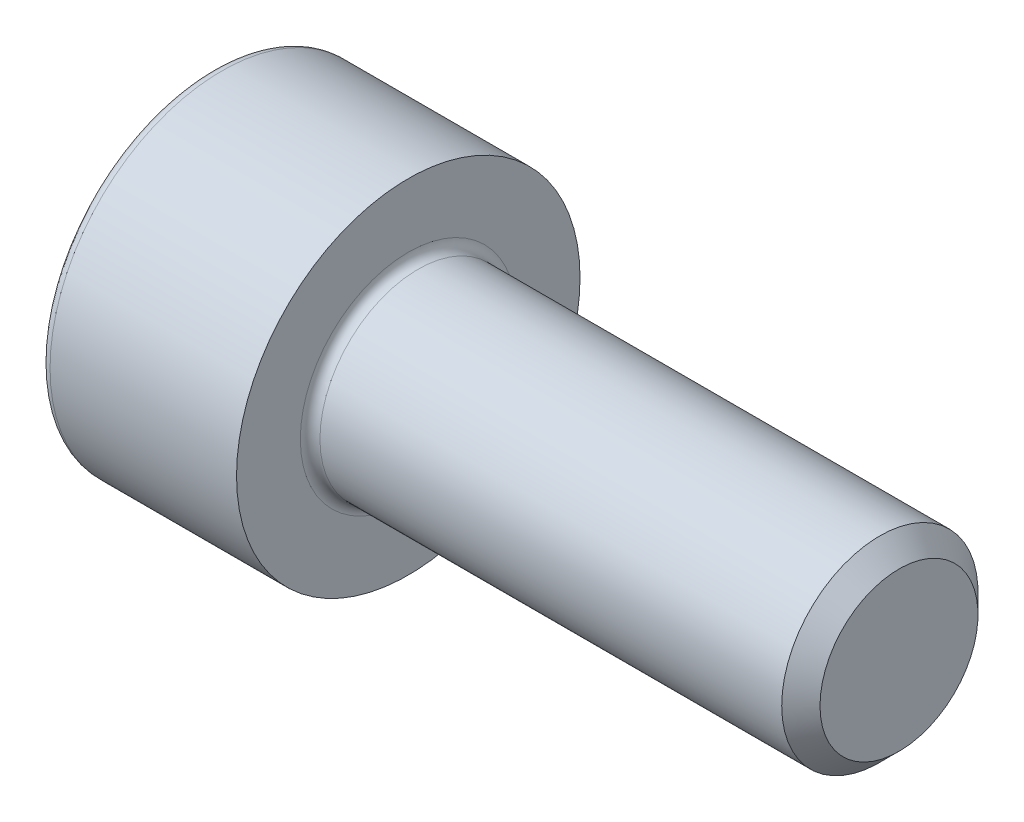
ISO-10303-21;
HEADER;
FILE_DESCRIPTION(('STEP AP214'),'2;1');
FILE_NAME('part.step','',(''),(''),'','','');
FILE_SCHEMA(('AUTOMOTIVE_DESIGN { 1 0 10303 214 1 1 1 1 }'));
ENDSEC;
DATA;
#1=APPLICATION_CONTEXT('core data for automotive mechanical design processes');
#2=APPLICATION_PROTOCOL_DEFINITION('international standard','automotive_design',2000,#1);
#3=PRODUCT_CONTEXT('',#1,'mechanical');
#4=PRODUCT('Part','Part','',(#3));
#5=PRODUCT_RELATED_PRODUCT_CATEGORY('part','',(#4));
#6=PRODUCT_DEFINITION_FORMATION('','',#4);
#7=PRODUCT_DEFINITION_CONTEXT('part definition',#1,'design');
#8=PRODUCT_DEFINITION('design','',#6,#7);
#9=PRODUCT_DEFINITION_SHAPE('','',#8);
#10=(LENGTH_UNIT() NAMED_UNIT(*) SI_UNIT(.MILLI.,.METRE.));
#11=(NAMED_UNIT(*) PLANE_ANGLE_UNIT() SI_UNIT($,.RADIAN.));
#12=(NAMED_UNIT(*) SI_UNIT($,.STERADIAN.) SOLID_ANGLE_UNIT());
#13=UNCERTAINTY_MEASURE_WITH_UNIT(LENGTH_MEASURE(1.E-05),#10,'distance_accuracy_value','');
#14=(GEOMETRIC_REPRESENTATION_CONTEXT(3) GLOBAL_UNCERTAINTY_ASSIGNED_CONTEXT((#13)) GLOBAL_UNIT_ASSIGNED_CONTEXT((#10,
#11,#12)) REPRESENTATION_CONTEXT('',''));
#15=CARTESIAN_POINT('',(0.,0.,0.));
#16=DIRECTION('',(0.,0.,1.));
#17=DIRECTION('',(1.,0.,0.));
#18=AXIS2_PLACEMENT_3D('',#15,#16,#17);
#19=CARTESIAN_POINT('',(2.,1.73205080756888,0.));
#20=DIRECTION('',(1.,0.,0.));
#21=DIRECTION('',(0.,0.,-1.));
#22=AXIS2_PLACEMENT_3D('',#19,#20,#21);
#23=PLANE('',#22);
#24=CARTESIAN_POINT('',(2.,0.,0.));
#25=DIRECTION('',(1.,0.,0.));
#26=DIRECTION('',(0.,0.,-1.));
#27=AXIS2_PLACEMENT_3D('',#24,#25,#26);
#28=CIRCLE('',#27,1.5);
#29=CARTESIAN_POINT('',(2.,0.,-1.5));
#30=VERTEX_POINT('',#29);
#31=CARTESIAN_POINT('',(2.,-1.29903810567666,-0.749999999999999));
#32=VERTEX_POINT('',#31);
#33=EDGE_CURVE('E11',#30,#32,#28,.F.);
#34=ORIENTED_EDGE('',*,*,#33,.F.);
#35=DIRECTION('',(0.,1.,0.));
#36=VECTOR('',#35,1.);
#37=CARTESIAN_POINT('',(2.,-0.866025403784439,-1.5));
#38=LINE('',#37,#36);
#39=CARTESIAN_POINT('',(2.,-0.866025403784439,-1.5));
#40=VERTEX_POINT('',#39);
#41=EDGE_CURVE('E177',#40,#30,#38,.T.);
#42=ORIENTED_EDGE('',*,*,#41,.F.);
#43=DIRECTION('',(0.,0.5,-0.866025403784439));
#44=VECTOR('',#43,1.);
#45=CARTESIAN_POINT('',(2.,-1.73205080756888,0.));
#46=LINE('',#45,#44);
#47=EDGE_CURVE('E173',#32,#40,#46,.T.);
#48=ORIENTED_EDGE('',*,*,#47,.F.);
#49=EDGE_LOOP('',(#34,#42,#48));
#50=FACE_BOUND('',#49,.T.);
#51=ADVANCED_FACE('F33',(#50),#23,.F.);
#52=CARTESIAN_POINT('',(2.,-1.29903810567666,0.75));
#53=VERTEX_POINT('',#52);
#54=EDGE_CURVE('E42',#32,#53,#28,.F.);
#55=ORIENTED_EDGE('',*,*,#54,.F.);
#56=CARTESIAN_POINT('',(2.,-1.73205080756888,0.));
#57=VERTEX_POINT('',#56);
#58=EDGE_CURVE('E174',#57,#32,#46,.T.);
#59=ORIENTED_EDGE('',*,*,#58,.F.);
#60=DIRECTION('',(0.,-0.5,-0.866025403784439));
#61=VECTOR('',#60,1.);
#62=CARTESIAN_POINT('',(2.,-0.866025403784439,1.5));
#63=LINE('',#62,#61);
#64=EDGE_CURVE('E169',#53,#57,#63,.T.);
#65=ORIENTED_EDGE('',*,*,#64,.F.);
#66=EDGE_LOOP('',(#55,#59,#65));
#67=FACE_BOUND('',#66,.T.);
#68=ADVANCED_FACE('F117',(#67),#23,.F.);
#69=CARTESIAN_POINT('',(2.,0.,1.5));
#70=VERTEX_POINT('',#69);
#71=EDGE_CURVE('E253',#53,#70,#28,.F.);
#72=ORIENTED_EDGE('',*,*,#71,.F.);
#73=CARTESIAN_POINT('',(2.,-0.866025403784439,1.5));
#74=VERTEX_POINT('',#73);
#75=EDGE_CURVE('E170',#74,#53,#63,.T.);
#76=ORIENTED_EDGE('',*,*,#75,.F.);
#77=DIRECTION('',(0.,-1.,0.));
#78=VECTOR('',#77,1.);
#79=CARTESIAN_POINT('',(2.,0.866025403784439,1.5));
#80=LINE('',#79,#78);
#81=EDGE_CURVE('E165',#70,#74,#80,.T.);
#82=ORIENTED_EDGE('',*,*,#81,.F.);
#83=EDGE_LOOP('',(#72,#76,#82));
#84=FACE_BOUND('',#83,.T.);
#85=ADVANCED_FACE('F123',(#84),#23,.F.);
#86=CARTESIAN_POINT('',(2.,0.,0.));
#87=DIRECTION('',(-1.,0.,0.));
#88=DIRECTION('',(0.,0.,1.));
#89=AXIS2_PLACEMENT_3D('',#86,#87,#88);
#90=CIRCLE('',#89,1.5);
#91=CARTESIAN_POINT('',(2.,1.29903810567666,0.75));
#92=VERTEX_POINT('',#91);
#93=EDGE_CURVE('E163',#70,#92,#90,.T.);
#94=ORIENTED_EDGE('',*,*,#93,.F.);
#95=CARTESIAN_POINT('',(2.,0.866025403784439,1.5));
#96=VERTEX_POINT('',#95);
#97=EDGE_CURVE('E166',#96,#70,#80,.T.);
#98=ORIENTED_EDGE('',*,*,#97,.F.);
#99=DIRECTION('',(0.,-0.5,0.866025403784439));
#100=VECTOR('',#99,1.);
#101=CARTESIAN_POINT('',(2.,1.73205080756888,0.));
#102=LINE('',#101,#100);
#103=EDGE_CURVE('E160',#92,#96,#102,.T.);
#104=ORIENTED_EDGE('',*,*,#103,.F.);
#105=EDGE_LOOP('',(#94,#98,#104));
#106=FACE_BOUND('',#105,.T.);
#107=ADVANCED_FACE('F137',(#106),#23,.F.);
#108=CARTESIAN_POINT('',(2.,1.29903810567666,-0.75));
#109=VERTEX_POINT('',#108);
#110=EDGE_CURVE('E49',#92,#109,#28,.F.);
#111=ORIENTED_EDGE('',*,*,#110,.F.);
#112=CARTESIAN_POINT('',(2.,1.73205080756888,0.));
#113=VERTEX_POINT('',#112);
#114=EDGE_CURVE('E151',#113,#92,#102,.T.);
#115=ORIENTED_EDGE('',*,*,#114,.F.);
#116=DIRECTION('',(0.,0.5,0.866025403784438));
#117=VECTOR('',#116,1.);
#118=CARTESIAN_POINT('',(2.,0.866025403784439,-1.5));
#119=LINE('',#118,#117);
#120=EDGE_CURVE('E148',#109,#113,#119,.T.);
#121=ORIENTED_EDGE('',*,*,#120,.F.);
#122=EDGE_LOOP('',(#111,#115,#121));
#123=FACE_BOUND('',#122,.T.);
#124=ADVANCED_FACE('F128',(#123),#23,.F.);
#125=EDGE_CURVE('E37',#109,#30,#28,.F.);
#126=ORIENTED_EDGE('',*,*,#125,.F.);
#127=CARTESIAN_POINT('',(2.,0.866025403784439,-1.5));
#128=VERTEX_POINT('',#127);
#129=EDGE_CURVE('E143',#128,#109,#119,.T.);
#130=ORIENTED_EDGE('',*,*,#129,.F.);
#131=EDGE_CURVE('E144',#30,#128,#38,.T.);
#132=ORIENTED_EDGE('',*,*,#131,.F.);
#133=EDGE_LOOP('',(#126,#130,#132));
#134=FACE_BOUND('',#133,.T.);
#135=ADVANCED_FACE('F119',(#134),#23,.F.);
#136=CARTESIAN_POINT('',(0.,0.,0.));
#137=DIRECTION('',(1.,0.,0.));
#138=DIRECTION('',(0.,0.,-1.));
#139=AXIS2_PLACEMENT_3D('',#136,#137,#138);
#140=PLANE('',#139);
#141=CARTESIAN_POINT('',(0.,0.,0.));
#142=DIRECTION('',(1.,0.,0.));
#143=DIRECTION('',(0.,0.,-1.));
#144=AXIS2_PLACEMENT_3D('',#141,#142,#143);
#145=CIRCLE('',#144,3.3);
#146=CARTESIAN_POINT('',(0.,0.,-3.3));
#147=VERTEX_POINT('',#146);
#148=EDGE_CURVE('E220',#147,#147,#145,.F.);
#149=ORIENTED_EDGE('',*,*,#148,.T.);
#150=EDGE_LOOP('',(#149));
#151=FACE_BOUND('',#150,.T.);
#152=DIRECTION('',(0.,0.5,0.866025403784438));
#153=VECTOR('',#152,1.);
#154=CARTESIAN_POINT('',(0.,0.866025403784439,-1.5));
#155=LINE('',#154,#153);
#156=CARTESIAN_POINT('',(0.,0.866025403784439,-1.5));
#157=VERTEX_POINT('',#156);
#158=CARTESIAN_POINT('',(0.,1.73205080756888,0.));
#159=VERTEX_POINT('',#158);
#160=EDGE_CURVE('E179',#157,#159,#155,.T.);
#161=ORIENTED_EDGE('',*,*,#160,.T.);
#162=DIRECTION('',(0.,-0.5,0.866025403784439));
#163=VECTOR('',#162,1.);
#164=CARTESIAN_POINT('',(0.,1.73205080756888,0.));
#165=LINE('',#164,#163);
#166=CARTESIAN_POINT('',(0.,0.866025403784439,1.5));
#167=VERTEX_POINT('',#166);
#168=EDGE_CURVE('E181',#159,#167,#165,.T.);
#169=ORIENTED_EDGE('',*,*,#168,.T.);
#170=DIRECTION('',(0.,-1.,0.));
#171=VECTOR('',#170,1.);
#172=CARTESIAN_POINT('',(0.,0.866025403784439,1.5));
#173=LINE('',#172,#171);
#174=CARTESIAN_POINT('',(0.,-0.866025403784439,1.5));
#175=VERTEX_POINT('',#174);
#176=EDGE_CURVE('E183',#167,#175,#173,.T.);
#177=ORIENTED_EDGE('',*,*,#176,.T.);
#178=DIRECTION('',(0.,-0.5,-0.866025403784439));
#179=VECTOR('',#178,1.);
#180=CARTESIAN_POINT('',(0.,-0.866025403784439,1.5));
#181=LINE('',#180,#179);
#182=CARTESIAN_POINT('',(0.,-1.73205080756888,0.));
#183=VERTEX_POINT('',#182);
#184=EDGE_CURVE('E185',#175,#183,#181,.T.);
#185=ORIENTED_EDGE('',*,*,#184,.T.);
#186=DIRECTION('',(0.,0.5,-0.866025403784439));
#187=VECTOR('',#186,1.);
#188=CARTESIAN_POINT('',(0.,-1.73205080756888,0.));
#189=LINE('',#188,#187);
#190=CARTESIAN_POINT('',(0.,-0.866025403784439,-1.5));
#191=VERTEX_POINT('',#190);
#192=EDGE_CURVE('E187',#183,#191,#189,.T.);
#193=ORIENTED_EDGE('',*,*,#192,.T.);
#194=DIRECTION('',(0.,1.,0.));
#195=VECTOR('',#194,1.);
#196=CARTESIAN_POINT('',(0.,-0.866025403784439,-1.5));
#197=LINE('',#196,#195);
#198=EDGE_CURVE('E57',#191,#157,#197,.T.);
#199=ORIENTED_EDGE('',*,*,#198,.T.);
#200=EDGE_LOOP('',(#161,#169,#177,#185,#193,#199));
#201=FACE_BOUND('',#200,.T.);
#202=ADVANCED_FACE('F127',(#151,#201),#140,.F.);
#203=CARTESIAN_POINT('',(0.,0.,0.));
#204=DIRECTION('',(-1.,0.,0.));
#205=DIRECTION('',(0.,0.,1.));
#206=AXIS2_PLACEMENT_3D('',#203,#204,#205);
#207=CYLINDRICAL_SURFACE('',#206,3.5);
#208=CARTESIAN_POINT('',(0.2,0.,0.));
#209=DIRECTION('',(1.,0.,0.));
#210=DIRECTION('',(0.,0.,-1.));
#211=AXIS2_PLACEMENT_3D('',#208,#209,#210);
#212=CIRCLE('',#211,3.5);
#213=CARTESIAN_POINT('',(0.2,0.,-3.5));
#214=VERTEX_POINT('',#213);
#215=EDGE_CURVE('E146',#214,#214,#212,.T.);
#216=ORIENTED_EDGE('',*,*,#215,.T.);
#217=EDGE_LOOP('',(#216));
#218=FACE_BOUND('',#217,.T.);
#219=CARTESIAN_POINT('',(4.,0.,0.));
#220=DIRECTION('',(-1.,0.,0.));
#221=DIRECTION('',(0.,0.,1.));
#222=AXIS2_PLACEMENT_3D('',#219,#220,#221);
#223=CIRCLE('',#222,3.5);
#224=CARTESIAN_POINT('',(4.,0.,3.5));
#225=VERTEX_POINT('',#224);
#226=EDGE_CURVE('E211',#225,#225,#223,.T.);
#227=ORIENTED_EDGE('',*,*,#226,.T.);
#228=EDGE_LOOP('',(#227));
#229=FACE_BOUND('',#228,.T.);
#230=ADVANCED_FACE('F134',(#218,#229),#207,.T.);
#231=CARTESIAN_POINT('',(4.,3.5,0.));
#232=DIRECTION('',(-1.,0.,0.));
#233=DIRECTION('',(0.,0.,1.));
#234=AXIS2_PLACEMENT_3D('',#231,#232,#233);
#235=PLANE('',#234);
#236=CARTESIAN_POINT('',(4.,0.,0.));
#237=DIRECTION('',(-1.,0.,0.));
#238=DIRECTION('',(0.,0.,1.));
#239=AXIS2_PLACEMENT_3D('',#236,#237,#238);
#240=CIRCLE('',#239,2.2);
#241=CARTESIAN_POINT('',(4.,0.,2.2));
#242=VERTEX_POINT('',#241);
#243=EDGE_CURVE('E214',#242,#242,#240,.T.);
#244=ORIENTED_EDGE('',*,*,#243,.T.);
#245=EDGE_LOOP('',(#244));
#246=FACE_BOUND('',#245,.T.);
#247=ORIENTED_EDGE('',*,*,#226,.F.);
#248=EDGE_LOOP('',(#247));
#249=FACE_BOUND('',#248,.T.);
#250=ADVANCED_FACE('F362',(#246,#249),#235,.F.);
#251=CARTESIAN_POINT('',(0.,0.,0.));
#252=DIRECTION('',(-1.,0.,0.));
#253=DIRECTION('',(0.,0.,1.));
#254=AXIS2_PLACEMENT_3D('',#251,#252,#253);
#255=CYLINDRICAL_SURFACE('',#254,2.);
#256=CARTESIAN_POINT('',(4.2,0.,0.));
#257=DIRECTION('',(-1.,0.,0.));
#258=DIRECTION('',(0.,0.,1.));
#259=AXIS2_PLACEMENT_3D('',#256,#257,#258);
#260=CIRCLE('',#259,2.);
#261=CARTESIAN_POINT('',(4.2,0.,2.));
#262=VERTEX_POINT('',#261);
#263=EDGE_CURVE('E217',#262,#262,#260,.F.);
#264=ORIENTED_EDGE('',*,*,#263,.T.);
#265=EDGE_LOOP('',(#264));
#266=FACE_BOUND('',#265,.T.);
#267=CARTESIAN_POINT('',(13.61,0.,0.));
#268=DIRECTION('',(-1.,0.,0.));
#269=DIRECTION('',(0.,0.,1.));
#270=AXIS2_PLACEMENT_3D('',#267,#268,#269);
#271=CIRCLE('',#270,2.);
#272=CARTESIAN_POINT('',(13.61,0.,2.));
#273=VERTEX_POINT('',#272);
#274=EDGE_CURVE('E208',#273,#273,#271,.T.);
#275=ORIENTED_EDGE('',*,*,#274,.T.);
#276=EDGE_LOOP('',(#275));
#277=FACE_BOUND('',#276,.T.);
#278=ADVANCED_FACE('F378',(#266,#277),#255,.T.);
#279=CARTESIAN_POINT('',(14.,0.,0.));
#280=DIRECTION('',(-1.,0.,0.));
#281=DIRECTION('',(0.,0.,1.));
#282=AXIS2_PLACEMENT_3D('',#279,#280,#281);
#283=CONICAL_SURFACE('',#282,1.61,0.785398163397449);
#284=ORIENTED_EDGE('',*,*,#274,.F.);
#285=EDGE_LOOP('',(#284));
#286=FACE_BOUND('',#285,.T.);
#287=CARTESIAN_POINT('',(14.,0.,0.));
#288=DIRECTION('',(-1.,0.,0.));
#289=DIRECTION('',(0.,0.,1.));
#290=AXIS2_PLACEMENT_3D('',#287,#288,#289);
#291=CIRCLE('',#290,1.61);
#292=CARTESIAN_POINT('',(14.,0.,1.61));
#293=VERTEX_POINT('',#292);
#294=EDGE_CURVE('E205',#293,#293,#291,.T.);
#295=ORIENTED_EDGE('',*,*,#294,.T.);
#296=EDGE_LOOP('',(#295));
#297=FACE_BOUND('',#296,.T.);
#298=ADVANCED_FACE('F383',(#286,#297),#283,.T.);
#299=CARTESIAN_POINT('',(14.,1.61,0.));
#300=DIRECTION('',(-1.,0.,0.));
#301=DIRECTION('',(0.,0.,1.));
#302=AXIS2_PLACEMENT_3D('',#299,#300,#301);
#303=PLANE('',#302);
#304=ORIENTED_EDGE('',*,*,#294,.F.);
#305=EDGE_LOOP('',(#304));
#306=FACE_BOUND('',#305,.T.);
#307=ADVANCED_FACE('F371',(#306),#303,.F.);
#308=CARTESIAN_POINT('',(4.2,0.,0.));
#309=DIRECTION('',(-1.,0.,0.));
#310=DIRECTION('',(0.,0.,1.));
#311=AXIS2_PLACEMENT_3D('',#308,#309,#310);
#312=TOROIDAL_SURFACE('',#311,2.2,0.2);
#313=ORIENTED_EDGE('',*,*,#263,.F.);
#314=EDGE_LOOP('',(#313));
#315=FACE_BOUND('',#314,.T.);
#316=ORIENTED_EDGE('',*,*,#243,.F.);
#317=EDGE_LOOP('',(#316));
#318=FACE_BOUND('',#317,.T.);
#319=ADVANCED_FACE('F229',(#315,#318),#312,.F.);
#320=CARTESIAN_POINT('',(0.2,0.,0.));
#321=DIRECTION('',(1.,0.,0.));
#322=DIRECTION('',(0.,0.,-1.));
#323=AXIS2_PLACEMENT_3D('',#320,#321,#322);
#324=TOROIDAL_SURFACE('',#323,3.3,0.2);
#325=ORIENTED_EDGE('',*,*,#215,.F.);
#326=EDGE_LOOP('',(#325));
#327=FACE_BOUND('',#326,.T.);
#328=ORIENTED_EDGE('',*,*,#148,.F.);
#329=EDGE_LOOP('',(#328));
#330=FACE_BOUND('',#329,.T.);
#331=ADVANCED_FACE('F35',(#327,#330),#324,.T.);
#332=CARTESIAN_POINT('',(2.,0.866025403784439,-1.5));
#333=DIRECTION('',(0.,-0.866025403784439,0.5));
#334=DIRECTION('',(0.,-0.5,-0.866025403784438));
#335=AXIS2_PLACEMENT_3D('',#332,#333,#334);
#336=PLANE('',#335);
#337=ORIENTED_EDGE('',*,*,#129,.T.);
#338=ORIENTED_EDGE('',*,*,#120,.T.);
#339=DIRECTION('',(-1.,0.,0.));
#340=VECTOR('',#339,1.);
#341=CARTESIAN_POINT('',(2.,1.73205080756888,0.));
#342=LINE('',#341,#340);
#343=EDGE_CURVE('E203',#113,#159,#342,.T.);
#344=ORIENTED_EDGE('',*,*,#343,.T.);
#345=ORIENTED_EDGE('',*,*,#160,.F.);
#346=DIRECTION('',(-1.,0.,0.));
#347=VECTOR('',#346,1.);
#348=CARTESIAN_POINT('',(2.,0.866025403784439,-1.5));
#349=LINE('',#348,#347);
#350=EDGE_CURVE('E159',#128,#157,#349,.T.);
#351=ORIENTED_EDGE('',*,*,#350,.F.);
#352=EDGE_LOOP('',(#337,#338,#344,#345,#351));
#353=FACE_BOUND('',#352,.T.);
#354=ADVANCED_FACE('F157',(#353),#336,.T.);
#355=CARTESIAN_POINT('',(2.,1.73205080756888,0.));
#356=DIRECTION('',(0.,-0.866025403784439,-0.5));
#357=DIRECTION('',(0.,0.5,-0.866025403784439));
#358=AXIS2_PLACEMENT_3D('',#355,#356,#357);
#359=PLANE('',#358);
#360=ORIENTED_EDGE('',*,*,#114,.T.);
#361=ORIENTED_EDGE('',*,*,#103,.T.);
#362=DIRECTION('',(-1.,0.,0.));
#363=VECTOR('',#362,1.);
#364=CARTESIAN_POINT('',(2.,0.866025403784439,1.5));
#365=LINE('',#364,#363);
#366=EDGE_CURVE('E200',#96,#167,#365,.T.);
#367=ORIENTED_EDGE('',*,*,#366,.T.);
#368=ORIENTED_EDGE('',*,*,#168,.F.);
#369=ORIENTED_EDGE('',*,*,#343,.F.);
#370=EDGE_LOOP('',(#360,#361,#367,#368,#369));
#371=FACE_BOUND('',#370,.T.);
#372=ADVANCED_FACE('F233',(#371),#359,.T.);
#373=CARTESIAN_POINT('',(2.,0.866025403784439,1.5));
#374=DIRECTION('',(0.,0.,-1.));
#375=DIRECTION('',(-1.,0.,0.));
#376=AXIS2_PLACEMENT_3D('',#373,#374,#375);
#377=PLANE('',#376);
#378=ORIENTED_EDGE('',*,*,#97,.T.);
#379=ORIENTED_EDGE('',*,*,#81,.T.);
#380=DIRECTION('',(-1.,0.,0.));
#381=VECTOR('',#380,1.);
#382=CARTESIAN_POINT('',(2.,-0.866025403784439,1.5));
#383=LINE('',#382,#381);
#384=EDGE_CURVE('E197',#74,#175,#383,.T.);
#385=ORIENTED_EDGE('',*,*,#384,.T.);
#386=ORIENTED_EDGE('',*,*,#176,.F.);
#387=ORIENTED_EDGE('',*,*,#366,.F.);
#388=EDGE_LOOP('',(#378,#379,#385,#386,#387));
#389=FACE_BOUND('',#388,.T.);
#390=ADVANCED_FACE('F238',(#389),#377,.T.);
#391=CARTESIAN_POINT('',(2.,-0.866025403784439,1.5));
#392=DIRECTION('',(0.,0.866025403784439,-0.5));
#393=DIRECTION('',(0.,0.5,0.866025403784439));
#394=AXIS2_PLACEMENT_3D('',#391,#392,#393);
#395=PLANE('',#394);
#396=ORIENTED_EDGE('',*,*,#75,.T.);
#397=ORIENTED_EDGE('',*,*,#64,.T.);
#398=DIRECTION('',(-1.,0.,0.));
#399=VECTOR('',#398,1.);
#400=CARTESIAN_POINT('',(2.,-1.73205080756888,0.));
#401=LINE('',#400,#399);
#402=EDGE_CURVE('E194',#57,#183,#401,.T.);
#403=ORIENTED_EDGE('',*,*,#402,.T.);
#404=ORIENTED_EDGE('',*,*,#184,.F.);
#405=ORIENTED_EDGE('',*,*,#384,.F.);
#406=EDGE_LOOP('',(#396,#397,#403,#404,#405));
#407=FACE_BOUND('',#406,.T.);
#408=ADVANCED_FACE('F244',(#407),#395,.T.);
#409=CARTESIAN_POINT('',(2.,-1.73205080756888,0.));
#410=DIRECTION('',(0.,0.866025403784439,0.5));
#411=DIRECTION('',(0.,-0.5,0.866025403784439));
#412=AXIS2_PLACEMENT_3D('',#409,#410,#411);
#413=PLANE('',#412);
#414=ORIENTED_EDGE('',*,*,#58,.T.);
#415=ORIENTED_EDGE('',*,*,#47,.T.);
#416=DIRECTION('',(-1.,0.,0.));
#417=VECTOR('',#416,1.);
#418=CARTESIAN_POINT('',(2.,-0.866025403784439,-1.5));
#419=LINE('',#418,#417);
#420=EDGE_CURVE('E191',#40,#191,#419,.T.);
#421=ORIENTED_EDGE('',*,*,#420,.T.);
#422=ORIENTED_EDGE('',*,*,#192,.F.);
#423=ORIENTED_EDGE('',*,*,#402,.F.);
#424=EDGE_LOOP('',(#414,#415,#421,#422,#423));
#425=FACE_BOUND('',#424,.T.);
#426=ADVANCED_FACE('F112',(#425),#413,.T.);
#427=CARTESIAN_POINT('',(2.,-0.866025403784439,-1.5));
#428=DIRECTION('',(0.,0.,1.));
#429=DIRECTION('',(0.,-1.,0.));
#430=AXIS2_PLACEMENT_3D('',#427,#428,#429);
#431=PLANE('',#430);
#432=ORIENTED_EDGE('',*,*,#41,.T.);
#433=ORIENTED_EDGE('',*,*,#131,.T.);
#434=ORIENTED_EDGE('',*,*,#350,.T.);
#435=ORIENTED_EDGE('',*,*,#198,.F.);
#436=ORIENTED_EDGE('',*,*,#420,.F.);
#437=EDGE_LOOP('',(#432,#433,#434,#435,#436));
#438=FACE_BOUND('',#437,.T.);
#439=ADVANCED_FACE('F107',(#438),#431,.T.);
#440=CARTESIAN_POINT('',(2.86602540378445,0.,0.));
#441=DIRECTION('',(-1.,0.,0.));
#442=DIRECTION('',(0.,0.,1.));
#443=AXIS2_PLACEMENT_3D('',#440,#441,#442);
#444=CONICAL_SURFACE('',#443,0.,1.04719755119659);
#445=ORIENTED_EDGE('',*,*,#93,.T.);
#446=ORIENTED_EDGE('',*,*,#110,.T.);
#447=ORIENTED_EDGE('',*,*,#125,.T.);
#448=ORIENTED_EDGE('',*,*,#33,.T.);
#449=ORIENTED_EDGE('',*,*,#54,.T.);
#450=ORIENTED_EDGE('',*,*,#71,.T.);
#451=EDGE_LOOP('',(#445,#446,#447,#448,#449,#450));
#452=FACE_BOUND('',#451,.T.);
#453=CARTESIAN_POINT('',(2.86602540378445,0.,0.));
#454=VERTEX_POINT('',#453);
#455=VERTEX_LOOP('',#454);
#456=FACE_BOUND('',#455,.T.);
#457=ADVANCED_FACE('F105',(#452,#456),#444,.F.);
#458=CLOSED_SHELL('',(#51,#68,#85,#107,#124,#135,#202,#230,#250,#278,#298,#307,#319,#331,#354,
#372,#390,#408,#426,#439,#457));
#459=MANIFOLD_SOLID_BREP('B2',#458);
#460=ADVANCED_BREP_SHAPE_REPRESENTATION('',(#18,#459),#14);
#461=SHAPE_DEFINITION_REPRESENTATION(#9,#460);
ENDSEC;
END-ISO-10303-21;
